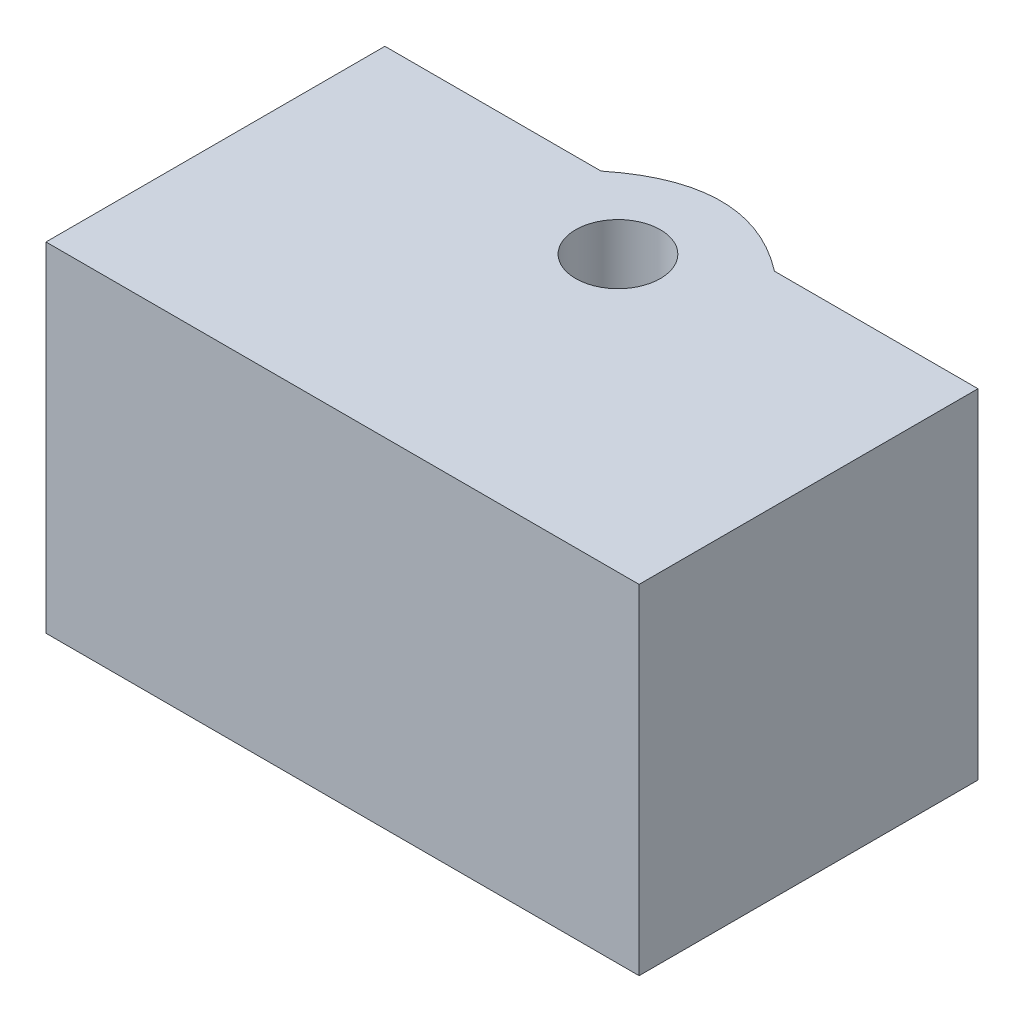
ISO-10303-21;
HEADER;
FILE_DESCRIPTION(('STEP AP214'),'2;1');
FILE_NAME('part.step','',(''),(''),'','','');
FILE_SCHEMA(('AUTOMOTIVE_DESIGN { 1 0 10303 214 1 1 1 1 }'));
ENDSEC;
DATA;
#1=APPLICATION_CONTEXT('core data for automotive mechanical design processes');
#2=APPLICATION_PROTOCOL_DEFINITION('international standard','automotive_design',2000,#1);
#3=PRODUCT_CONTEXT('',#1,'mechanical');
#4=PRODUCT('Part','Part','',(#3));
#5=PRODUCT_RELATED_PRODUCT_CATEGORY('part','',(#4));
#6=PRODUCT_DEFINITION_FORMATION('','',#4);
#7=PRODUCT_DEFINITION_CONTEXT('part definition',#1,'design');
#8=PRODUCT_DEFINITION('design','',#6,#7);
#9=PRODUCT_DEFINITION_SHAPE('','',#8);
#10=(LENGTH_UNIT() NAMED_UNIT(*) SI_UNIT(.MILLI.,.METRE.));
#11=(NAMED_UNIT(*) PLANE_ANGLE_UNIT() SI_UNIT($,.RADIAN.));
#12=(NAMED_UNIT(*) SI_UNIT($,.STERADIAN.) SOLID_ANGLE_UNIT());
#13=UNCERTAINTY_MEASURE_WITH_UNIT(LENGTH_MEASURE(1.E-05),#10,'distance_accuracy_value','');
#14=(GEOMETRIC_REPRESENTATION_CONTEXT(3) GLOBAL_UNCERTAINTY_ASSIGNED_CONTEXT((#13)) GLOBAL_UNIT_ASSIGNED_CONTEXT((#10,
#11,#12)) REPRESENTATION_CONTEXT('',''));
#15=CARTESIAN_POINT('',(0.,0.,0.));
#16=DIRECTION('',(0.,0.,1.));
#17=DIRECTION('',(1.,0.,0.));
#18=AXIS2_PLACEMENT_3D('',#15,#16,#17);
#19=CARTESIAN_POINT('',(1.24826760463037,20.,-5.75577079516273));
#20=DIRECTION('',(0.,1.,0.));
#21=DIRECTION('',(0.,0.,1.));
#22=AXIS2_PLACEMENT_3D('',#19,#20,#21);
#23=PLANE('',#22);
#24=DIRECTION('',(-1.,0.,0.));
#25=VECTOR('',#24,1.);
#26=CARTESIAN_POINT('',(-16.5729288343959,20.,-3.74536750904071));
#27=LINE('',#26,#25);
#28=CARTESIAN_POINT('',(-3.81953320228905,20.,-3.74536750904071));
#29=VERTEX_POINT('',#28);
#30=CARTESIAN_POINT('',(-16.5729288343959,20.,-3.74536750904071));
#31=VERTEX_POINT('',#30);
#32=EDGE_CURVE('E167',#29,#31,#27,.T.);
#33=ORIENTED_EDGE('',*,*,#32,.T.);
#34=DIRECTION('',(0.,0.,1.));
#35=VECTOR('',#34,1.);
#36=CARTESIAN_POINT('',(-16.5729288343959,20.,-3.74536750904071));
#37=LINE('',#36,#35);
#38=CARTESIAN_POINT('',(-16.5729288343959,20.,16.2546324909593));
#39=VERTEX_POINT('',#38);
#40=EDGE_CURVE('E86',#31,#39,#37,.T.);
#41=ORIENTED_EDGE('',*,*,#40,.T.);
#42=DIRECTION('',(1.,0.,0.));
#43=VECTOR('',#42,1.);
#44=CARTESIAN_POINT('',(-16.5729288343959,20.,16.2546324909593));
#45=LINE('',#44,#43);
#46=CARTESIAN_POINT('',(18.4270711656041,20.,16.2546324909593));
#47=VERTEX_POINT('',#46);
#48=EDGE_CURVE('E99',#39,#47,#45,.T.);
#49=ORIENTED_EDGE('',*,*,#48,.T.);
#50=DIRECTION('',(0.,0.,-1.));
#51=VECTOR('',#50,1.);
#52=CARTESIAN_POINT('',(18.4270711656041,20.,16.2546324909593));
#53=LINE('',#52,#51);
#54=CARTESIAN_POINT('',(18.4270711656041,20.,-3.74536750904071));
#55=VERTEX_POINT('',#54);
#56=EDGE_CURVE('E93',#47,#55,#53,.T.);
#57=ORIENTED_EDGE('',*,*,#56,.T.);
#58=DIRECTION('',(-1.,0.,0.));
#59=VECTOR('',#58,1.);
#60=CARTESIAN_POINT('',(18.4270711656041,20.,-3.74536750904071));
#61=LINE('',#60,#59);
#62=CARTESIAN_POINT('',(6.41533246598062,20.,-3.74536750904071));
#63=VERTEX_POINT('',#62);
#64=EDGE_CURVE('E97',#55,#63,#61,.T.);
#65=ORIENTED_EDGE('',*,*,#64,.T.);
#66=CARTESIAN_POINT('',(6.41533246598062,20.,-3.74536750904071));
#67=CARTESIAN_POINT('',(1.19863557741495,20.,-7.76617408128475));
#68=CARTESIAN_POINT('',(-3.81953320228905,20.,-3.74536750904071));
#69=B_SPLINE_CURVE_WITH_KNOTS('',2,(#66,#67,#68),.UNSPECIFIED.,.F.,.F.,(3,3),(0.,1.),.UNSPECIFIED.);
#70=EDGE_CURVE('E49',#63,#29,#69,.T.);
#71=ORIENTED_EDGE('',*,*,#70,.T.);
#72=EDGE_LOOP('',(#33,#41,#49,#57,#65,#71));
#73=FACE_BOUND('',#72,.T.);
#74=CARTESIAN_POINT('',(0.927071165604125,20.,0.));
#75=DIRECTION('',(0.,1.,0.));
#76=DIRECTION('',(0.,0.,1.));
#77=AXIS2_PLACEMENT_3D('',#74,#75,#76);
#78=CIRCLE('',#77,2.5);
#79=CARTESIAN_POINT('',(0.927071165604125,20.,2.5));
#80=VERTEX_POINT('',#79);
#81=EDGE_CURVE('E159',#80,#80,#78,.T.);
#82=ORIENTED_EDGE('',*,*,#81,.F.);
#83=EDGE_LOOP('',(#82));
#84=FACE_BOUND('',#83,.T.);
#85=ADVANCED_FACE('F32',(#73,#84),#23,.T.);
#86=CARTESIAN_POINT('',(1.24826760463037,0.,-5.75577079516273));
#87=DIRECTION('',(0.,1.,0.));
#88=DIRECTION('',(0.,0.,1.));
#89=AXIS2_PLACEMENT_3D('',#86,#87,#88);
#90=PLANE('',#89);
#91=DIRECTION('',(-1.,0.,0.));
#92=VECTOR('',#91,1.);
#93=CARTESIAN_POINT('',(-16.5729288343959,0.,-3.74536750904071));
#94=LINE('',#93,#92);
#95=CARTESIAN_POINT('',(-3.81953320228905,0.,-3.74536750904071));
#96=VERTEX_POINT('',#95);
#97=CARTESIAN_POINT('',(-16.5729288343959,0.,-3.74536750904071));
#98=VERTEX_POINT('',#97);
#99=EDGE_CURVE('E120',#96,#98,#94,.T.);
#100=ORIENTED_EDGE('',*,*,#99,.F.);
#101=CARTESIAN_POINT('',(6.41533246598062,0.,-3.74536750904071));
#102=CARTESIAN_POINT('',(1.19863557741495,0.,-7.76617408128475));
#103=CARTESIAN_POINT('',(-3.81953320228905,0.,-3.74536750904071));
#104=B_SPLINE_CURVE_WITH_KNOTS('',2,(#101,#102,#103),.UNSPECIFIED.,.F.,.F.,(3,3),(0.,1.),.UNSPECIFIED.);
#105=CARTESIAN_POINT('',(6.41533246598062,0.,-3.74536750904071));
#106=VERTEX_POINT('',#105);
#107=EDGE_CURVE('E78',#106,#96,#104,.T.);
#108=ORIENTED_EDGE('',*,*,#107,.F.);
#109=DIRECTION('',(-1.,0.,0.));
#110=VECTOR('',#109,1.);
#111=CARTESIAN_POINT('',(18.4270711656041,0.,-3.74536750904071));
#112=LINE('',#111,#110);
#113=CARTESIAN_POINT('',(18.4270711656041,0.,-3.74536750904071));
#114=VERTEX_POINT('',#113);
#115=EDGE_CURVE('E72',#114,#106,#112,.T.);
#116=ORIENTED_EDGE('',*,*,#115,.F.);
#117=DIRECTION('',(0.,0.,-1.));
#118=VECTOR('',#117,1.);
#119=CARTESIAN_POINT('',(18.4270711656041,0.,16.2546324909593));
#120=LINE('',#119,#118);
#121=CARTESIAN_POINT('',(18.4270711656041,0.,16.2546324909593));
#122=VERTEX_POINT('',#121);
#123=EDGE_CURVE('E107',#122,#114,#120,.T.);
#124=ORIENTED_EDGE('',*,*,#123,.F.);
#125=DIRECTION('',(1.,0.,0.));
#126=VECTOR('',#125,1.);
#127=CARTESIAN_POINT('',(-16.5729288343959,0.,16.2546324909593));
#128=LINE('',#127,#126);
#129=CARTESIAN_POINT('',(-16.5729288343959,0.,16.2546324909593));
#130=VERTEX_POINT('',#129);
#131=EDGE_CURVE('E174',#130,#122,#128,.T.);
#132=ORIENTED_EDGE('',*,*,#131,.F.);
#133=DIRECTION('',(0.,0.,1.));
#134=VECTOR('',#133,1.);
#135=CARTESIAN_POINT('',(-16.5729288343959,0.,-3.74536750904071));
#136=LINE('',#135,#134);
#137=EDGE_CURVE('E172',#98,#130,#136,.T.);
#138=ORIENTED_EDGE('',*,*,#137,.F.);
#139=EDGE_LOOP('',(#100,#108,#116,#124,#132,#138));
#140=FACE_BOUND('',#139,.T.);
#141=CARTESIAN_POINT('',(0.927071165604125,0.,0.));
#142=DIRECTION('',(0.,1.,0.));
#143=DIRECTION('',(0.,0.,1.));
#144=AXIS2_PLACEMENT_3D('',#141,#142,#143);
#145=CIRCLE('',#144,2.5);
#146=CARTESIAN_POINT('',(0.927071165604125,0.,2.5));
#147=VERTEX_POINT('',#146);
#148=EDGE_CURVE('E162',#147,#147,#145,.T.);
#149=ORIENTED_EDGE('',*,*,#148,.T.);
#150=EDGE_LOOP('',(#149));
#151=FACE_BOUND('',#150,.T.);
#152=ADVANCED_FACE('F131',(#140,#151),#90,.F.);
#153=CARTESIAN_POINT('',(-16.5729288343959,20.,-3.74536750904071));
#154=DIRECTION('',(0.,0.,1.));
#155=DIRECTION('',(1.,0.,0.));
#156=AXIS2_PLACEMENT_3D('',#153,#154,#155);
#157=PLANE('',#156);
#158=ORIENTED_EDGE('',*,*,#99,.T.);
#159=DIRECTION('',(0.,-1.,0.));
#160=VECTOR('',#159,1.);
#161=CARTESIAN_POINT('',(-16.5729288343959,20.,-3.74536750904071));
#162=LINE('',#161,#160);
#163=EDGE_CURVE('E11',#31,#98,#162,.T.);
#164=ORIENTED_EDGE('',*,*,#163,.F.);
#165=ORIENTED_EDGE('',*,*,#32,.F.);
#166=DIRECTION('',(0.,-1.,0.));
#167=VECTOR('',#166,1.);
#168=CARTESIAN_POINT('',(-3.81953320228905,20.,-3.74536750904071));
#169=LINE('',#168,#167);
#170=EDGE_CURVE('E113',#29,#96,#169,.T.);
#171=ORIENTED_EDGE('',*,*,#170,.T.);
#172=EDGE_LOOP('',(#158,#164,#165,#171));
#173=FACE_BOUND('',#172,.T.);
#174=ADVANCED_FACE('F34',(#173),#157,.F.);
#175=CARTESIAN_POINT('',(-16.5729288343959,20.,-3.74536750904071));
#176=DIRECTION('',(1.,0.,0.));
#177=DIRECTION('',(0.,0.,-1.));
#178=AXIS2_PLACEMENT_3D('',#175,#176,#177);
#179=PLANE('',#178);
#180=ORIENTED_EDGE('',*,*,#137,.T.);
#181=DIRECTION('',(0.,-1.,0.));
#182=VECTOR('',#181,1.);
#183=CARTESIAN_POINT('',(-16.5729288343959,20.,16.2546324909593));
#184=LINE('',#183,#182);
#185=EDGE_CURVE('E41',#39,#130,#184,.T.);
#186=ORIENTED_EDGE('',*,*,#185,.F.);
#187=ORIENTED_EDGE('',*,*,#40,.F.);
#188=ORIENTED_EDGE('',*,*,#163,.T.);
#189=EDGE_LOOP('',(#180,#186,#187,#188));
#190=FACE_BOUND('',#189,.T.);
#191=ADVANCED_FACE('F139',(#190),#179,.F.);
#192=CARTESIAN_POINT('',(-16.5729288343959,20.,16.2546324909593));
#193=DIRECTION('',(0.,0.,-1.));
#194=DIRECTION('',(-1.,0.,0.));
#195=AXIS2_PLACEMENT_3D('',#192,#193,#194);
#196=PLANE('',#195);
#197=ORIENTED_EDGE('',*,*,#131,.T.);
#198=DIRECTION('',(0.,-1.,0.));
#199=VECTOR('',#198,1.);
#200=CARTESIAN_POINT('',(18.4270711656041,20.,16.2546324909593));
#201=LINE('',#200,#199);
#202=EDGE_CURVE('E108',#47,#122,#201,.T.);
#203=ORIENTED_EDGE('',*,*,#202,.F.);
#204=ORIENTED_EDGE('',*,*,#48,.F.);
#205=ORIENTED_EDGE('',*,*,#185,.T.);
#206=EDGE_LOOP('',(#197,#203,#204,#205));
#207=FACE_BOUND('',#206,.T.);
#208=ADVANCED_FACE('F137',(#207),#196,.F.);
#209=CARTESIAN_POINT('',(18.4270711656041,20.,16.2546324909593));
#210=DIRECTION('',(-1.,0.,0.));
#211=DIRECTION('',(0.,0.,1.));
#212=AXIS2_PLACEMENT_3D('',#209,#210,#211);
#213=PLANE('',#212);
#214=ORIENTED_EDGE('',*,*,#123,.T.);
#215=DIRECTION('',(0.,-1.,0.));
#216=VECTOR('',#215,1.);
#217=CARTESIAN_POINT('',(18.4270711656041,20.,-3.74536750904071));
#218=LINE('',#217,#216);
#219=EDGE_CURVE('E104',#55,#114,#218,.T.);
#220=ORIENTED_EDGE('',*,*,#219,.F.);
#221=ORIENTED_EDGE('',*,*,#56,.F.);
#222=ORIENTED_EDGE('',*,*,#202,.T.);
#223=EDGE_LOOP('',(#214,#220,#221,#222));
#224=FACE_BOUND('',#223,.T.);
#225=ADVANCED_FACE('F105',(#224),#213,.F.);
#226=CARTESIAN_POINT('',(18.4270711656041,20.,-3.74536750904071));
#227=DIRECTION('',(0.,0.,1.));
#228=DIRECTION('',(1.,0.,0.));
#229=AXIS2_PLACEMENT_3D('',#226,#227,#228);
#230=PLANE('',#229);
#231=ORIENTED_EDGE('',*,*,#115,.T.);
#232=DIRECTION('',(0.,-1.,0.));
#233=VECTOR('',#232,1.);
#234=CARTESIAN_POINT('',(6.41533246598062,20.,-3.74536750904071));
#235=LINE('',#234,#233);
#236=EDGE_CURVE('E109',#63,#106,#235,.T.);
#237=ORIENTED_EDGE('',*,*,#236,.F.);
#238=ORIENTED_EDGE('',*,*,#64,.F.);
#239=ORIENTED_EDGE('',*,*,#219,.T.);
#240=EDGE_LOOP('',(#231,#237,#238,#239));
#241=FACE_BOUND('',#240,.T.);
#242=ADVANCED_FACE('F111',(#241),#230,.F.);
#243=DIRECTION('',(0.,-1.,0.));
#244=VECTOR('',#243,1.);
#245=SURFACE_OF_LINEAR_EXTRUSION('',#69,#244);
#246=ORIENTED_EDGE('',*,*,#107,.T.);
#247=ORIENTED_EDGE('',*,*,#170,.F.);
#248=ORIENTED_EDGE('',*,*,#70,.F.);
#249=ORIENTED_EDGE('',*,*,#236,.T.);
#250=EDGE_LOOP('',(#246,#247,#248,#249));
#251=FACE_BOUND('',#250,.T.);
#252=ADVANCED_FACE('F126',(#251),#245,.F.);
#253=CARTESIAN_POINT('',(0.927071165604125,20.,0.));
#254=DIRECTION('',(0.,-1.,0.));
#255=DIRECTION('',(0.,0.,-1.));
#256=AXIS2_PLACEMENT_3D('',#253,#254,#255);
#257=CYLINDRICAL_SURFACE('',#256,2.5);
#258=ORIENTED_EDGE('',*,*,#81,.T.);
#259=EDGE_LOOP('',(#258));
#260=FACE_BOUND('',#259,.T.);
#261=ORIENTED_EDGE('',*,*,#148,.F.);
#262=EDGE_LOOP('',(#261));
#263=FACE_BOUND('',#262,.T.);
#264=ADVANCED_FACE('F130',(#260,#263),#257,.F.);
#265=CLOSED_SHELL('',(#85,#152,#174,#191,#208,#225,#242,#252,#264));
#266=MANIFOLD_SOLID_BREP('B2',#265);
#267=ADVANCED_BREP_SHAPE_REPRESENTATION('',(#18,#266),#14);
#268=SHAPE_DEFINITION_REPRESENTATION(#9,#267);
ENDSEC;
END-ISO-10303-21;
